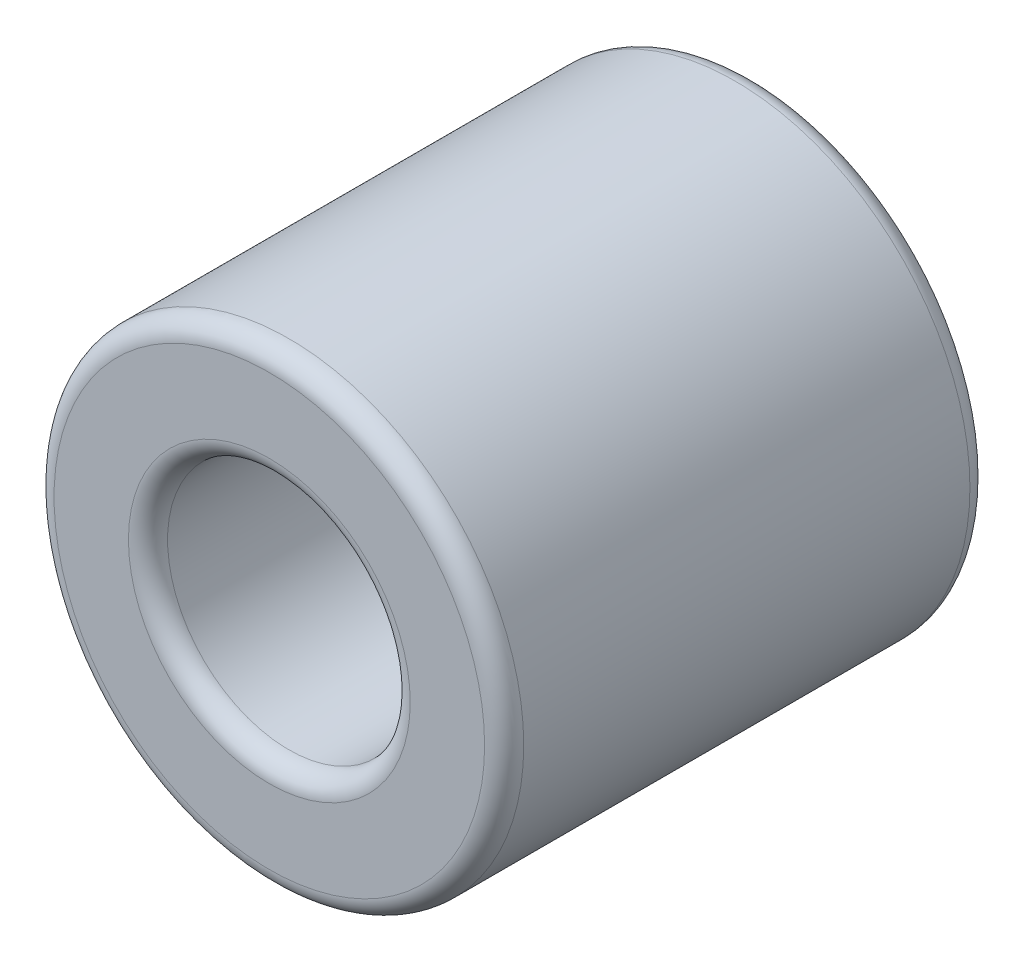
ISO-10303-21;
HEADER;
FILE_DESCRIPTION(('STEP AP214'),'2;1');
FILE_NAME('part.step','',(''),(''),'','','');
FILE_SCHEMA(('AUTOMOTIVE_DESIGN { 1 0 10303 214 1 1 1 1 }'));
ENDSEC;
DATA;
#1=APPLICATION_CONTEXT('core data for automotive mechanical design processes');
#2=APPLICATION_PROTOCOL_DEFINITION('international standard','automotive_design',2000,#1);
#3=PRODUCT_CONTEXT('',#1,'mechanical');
#4=PRODUCT('Part','Part','',(#3));
#5=PRODUCT_RELATED_PRODUCT_CATEGORY('part','',(#4));
#6=PRODUCT_DEFINITION_FORMATION('','',#4);
#7=PRODUCT_DEFINITION_CONTEXT('part definition',#1,'design');
#8=PRODUCT_DEFINITION('design','',#6,#7);
#9=PRODUCT_DEFINITION_SHAPE('','',#8);
#10=(LENGTH_UNIT() NAMED_UNIT(*) SI_UNIT(.MILLI.,.METRE.));
#11=(NAMED_UNIT(*) PLANE_ANGLE_UNIT() SI_UNIT($,.RADIAN.));
#12=(NAMED_UNIT(*) SI_UNIT($,.STERADIAN.) SOLID_ANGLE_UNIT());
#13=UNCERTAINTY_MEASURE_WITH_UNIT(LENGTH_MEASURE(1.E-05),#10,'distance_accuracy_value','');
#14=(GEOMETRIC_REPRESENTATION_CONTEXT(3) GLOBAL_UNCERTAINTY_ASSIGNED_CONTEXT((#13)) GLOBAL_UNIT_ASSIGNED_CONTEXT((#10,
#11,#12)) REPRESENTATION_CONTEXT('',''));
#15=CARTESIAN_POINT('',(0.,0.,0.));
#16=DIRECTION('',(0.,0.,1.));
#17=DIRECTION('',(1.,0.,0.));
#18=AXIS2_PLACEMENT_3D('',#15,#16,#17);
#19=CARTESIAN_POINT('',(0.,0.,6.2));
#20=DIRECTION('',(0.,0.,1.));
#21=DIRECTION('',(1.,0.,0.));
#22=AXIS2_PLACEMENT_3D('',#19,#20,#21);
#23=PLANE('',#22);
#24=CARTESIAN_POINT('',(0.,0.,6.2));
#25=DIRECTION('',(0.,0.,1.));
#26=DIRECTION('',(1.,0.,0.));
#27=AXIS2_PLACEMENT_3D('',#24,#25,#26);
#28=CIRCLE('',#27,1.8);
#29=CARTESIAN_POINT('',(1.8,0.,6.2));
#30=VERTEX_POINT('',#29);
#31=EDGE_CURVE('E42',#30,#30,#28,.F.);
#32=ORIENTED_EDGE('',*,*,#31,.T.);
#33=EDGE_LOOP('',(#32));
#34=FACE_BOUND('',#33,.T.);
#35=CARTESIAN_POINT('',(0.,0.,6.2));
#36=DIRECTION('',(0.,0.,1.));
#37=DIRECTION('',(1.,0.,0.));
#38=AXIS2_PLACEMENT_3D('',#35,#36,#37);
#39=CIRCLE('',#38,2.75);
#40=CARTESIAN_POINT('',(2.75,0.,6.2));
#41=VERTEX_POINT('',#40);
#42=EDGE_CURVE('E46',#41,#41,#39,.T.);
#43=ORIENTED_EDGE('',*,*,#42,.T.);
#44=EDGE_LOOP('',(#43));
#45=FACE_BOUND('',#44,.T.);
#46=ADVANCED_FACE('F31',(#34,#45),#23,.T.);
#47=CARTESIAN_POINT('',(0.,0.,0.));
#48=DIRECTION('',(0.,0.,1.));
#49=DIRECTION('',(1.,0.,0.));
#50=AXIS2_PLACEMENT_3D('',#47,#48,#49);
#51=PLANE('',#50);
#52=CARTESIAN_POINT('',(0.,0.,0.));
#53=DIRECTION('',(0.,0.,1.));
#54=DIRECTION('',(1.,0.,0.));
#55=AXIS2_PLACEMENT_3D('',#52,#53,#54);
#56=CIRCLE('',#55,1.8);
#57=CARTESIAN_POINT('',(1.8,0.,0.));
#58=VERTEX_POINT('',#57);
#59=EDGE_CURVE('E57',#58,#58,#56,.T.);
#60=ORIENTED_EDGE('',*,*,#59,.T.);
#61=EDGE_LOOP('',(#60));
#62=FACE_BOUND('',#61,.T.);
#63=CARTESIAN_POINT('',(0.,0.,0.));
#64=DIRECTION('',(0.,0.,1.));
#65=DIRECTION('',(1.,0.,0.));
#66=AXIS2_PLACEMENT_3D('',#63,#64,#65);
#67=CIRCLE('',#66,2.75);
#68=CARTESIAN_POINT('',(2.75,0.,0.));
#69=VERTEX_POINT('',#68);
#70=EDGE_CURVE('E60',#69,#69,#67,.F.);
#71=ORIENTED_EDGE('',*,*,#70,.T.);
#72=EDGE_LOOP('',(#71));
#73=FACE_BOUND('',#72,.T.);
#74=ADVANCED_FACE('F64',(#62,#73),#51,.F.);
#75=CARTESIAN_POINT('',(0.,0.,6.2));
#76=DIRECTION('',(0.,0.,-1.));
#77=DIRECTION('',(-1.,0.,0.));
#78=AXIS2_PLACEMENT_3D('',#75,#76,#77);
#79=CYLINDRICAL_SURFACE('',#78,3.);
#80=CARTESIAN_POINT('',(0.,0.,0.25));
#81=DIRECTION('',(0.,0.,1.));
#82=DIRECTION('',(1.,0.,0.));
#83=AXIS2_PLACEMENT_3D('',#80,#81,#82);
#84=CIRCLE('',#83,3.);
#85=CARTESIAN_POINT('',(3.,0.,0.25));
#86=VERTEX_POINT('',#85);
#87=EDGE_CURVE('E10',#86,#86,#84,.T.);
#88=ORIENTED_EDGE('',*,*,#87,.T.);
#89=EDGE_LOOP('',(#88));
#90=FACE_BOUND('',#89,.T.);
#91=CARTESIAN_POINT('',(0.,0.,5.95));
#92=DIRECTION('',(0.,0.,1.));
#93=DIRECTION('',(1.,0.,0.));
#94=AXIS2_PLACEMENT_3D('',#91,#92,#93);
#95=CIRCLE('',#94,3.);
#96=CARTESIAN_POINT('',(3.,0.,5.95));
#97=VERTEX_POINT('',#96);
#98=EDGE_CURVE('E38',#97,#97,#95,.F.);
#99=ORIENTED_EDGE('',*,*,#98,.T.);
#100=EDGE_LOOP('',(#99));
#101=FACE_BOUND('',#100,.T.);
#102=ADVANCED_FACE('F84',(#90,#101),#79,.T.);
#103=CARTESIAN_POINT('',(0.,0.,6.2));
#104=DIRECTION('',(0.,0.,-1.));
#105=DIRECTION('',(-1.,0.,0.));
#106=AXIS2_PLACEMENT_3D('',#103,#104,#105);
#107=CYLINDRICAL_SURFACE('',#106,1.55);
#108=CARTESIAN_POINT('',(0.,0.,0.25));
#109=DIRECTION('',(0.,0.,1.));
#110=DIRECTION('',(1.,0.,0.));
#111=AXIS2_PLACEMENT_3D('',#108,#109,#110);
#112=CIRCLE('',#111,1.55);
#113=CARTESIAN_POINT('',(1.55,0.,0.25));
#114=VERTEX_POINT('',#113);
#115=EDGE_CURVE('E51',#114,#114,#112,.F.);
#116=ORIENTED_EDGE('',*,*,#115,.T.);
#117=EDGE_LOOP('',(#116));
#118=FACE_BOUND('',#117,.T.);
#119=CARTESIAN_POINT('',(0.,0.,5.95));
#120=DIRECTION('',(0.,0.,1.));
#121=DIRECTION('',(1.,0.,0.));
#122=AXIS2_PLACEMENT_3D('',#119,#120,#121);
#123=CIRCLE('',#122,1.55);
#124=CARTESIAN_POINT('',(1.55,0.,5.95));
#125=VERTEX_POINT('',#124);
#126=EDGE_CURVE('E54',#125,#125,#123,.T.);
#127=ORIENTED_EDGE('',*,*,#126,.T.);
#128=EDGE_LOOP('',(#127));
#129=FACE_BOUND('',#128,.T.);
#130=ADVANCED_FACE('F89',(#118,#129),#107,.F.);
#131=CARTESIAN_POINT('',(0.,0.,0.25));
#132=DIRECTION('',(0.,0.,1.));
#133=DIRECTION('',(1.,0.,0.));
#134=AXIS2_PLACEMENT_3D('',#131,#132,#133);
#135=TOROIDAL_SURFACE('',#134,1.8,0.25);
#136=ORIENTED_EDGE('',*,*,#115,.F.);
#137=EDGE_LOOP('',(#136));
#138=FACE_BOUND('',#137,.T.);
#139=ORIENTED_EDGE('',*,*,#59,.F.);
#140=EDGE_LOOP('',(#139));
#141=FACE_BOUND('',#140,.T.);
#142=ADVANCED_FACE('F75',(#138,#141),#135,.T.);
#143=CARTESIAN_POINT('',(0.,0.,5.95));
#144=DIRECTION('',(0.,0.,1.));
#145=DIRECTION('',(1.,0.,0.));
#146=AXIS2_PLACEMENT_3D('',#143,#144,#145);
#147=TOROIDAL_SURFACE('',#146,1.8,0.25);
#148=ORIENTED_EDGE('',*,*,#31,.F.);
#149=EDGE_LOOP('',(#148));
#150=FACE_BOUND('',#149,.T.);
#151=ORIENTED_EDGE('',*,*,#126,.F.);
#152=EDGE_LOOP('',(#151));
#153=FACE_BOUND('',#152,.T.);
#154=ADVANCED_FACE('F69',(#150,#153),#147,.T.);
#155=CARTESIAN_POINT('',(0.,0.,0.25));
#156=DIRECTION('',(0.,0.,1.));
#157=DIRECTION('',(1.,0.,0.));
#158=AXIS2_PLACEMENT_3D('',#155,#156,#157);
#159=TOROIDAL_SURFACE('',#158,2.75,0.25);
#160=ORIENTED_EDGE('',*,*,#70,.F.);
#161=EDGE_LOOP('',(#160));
#162=FACE_BOUND('',#161,.T.);
#163=ORIENTED_EDGE('',*,*,#87,.F.);
#164=EDGE_LOOP('',(#163));
#165=FACE_BOUND('',#164,.T.);
#166=ADVANCED_FACE('F66',(#162,#165),#159,.T.);
#167=CARTESIAN_POINT('',(0.,0.,5.95));
#168=DIRECTION('',(0.,0.,1.));
#169=DIRECTION('',(1.,0.,0.));
#170=AXIS2_PLACEMENT_3D('',#167,#168,#169);
#171=TOROIDAL_SURFACE('',#170,2.75,0.25);
#172=ORIENTED_EDGE('',*,*,#98,.F.);
#173=EDGE_LOOP('',(#172));
#174=FACE_BOUND('',#173,.T.);
#175=ORIENTED_EDGE('',*,*,#42,.F.);
#176=EDGE_LOOP('',(#175));
#177=FACE_BOUND('',#176,.T.);
#178=ADVANCED_FACE('F33',(#174,#177),#171,.T.);
#179=CLOSED_SHELL('',(#46,#74,#102,#130,#142,#154,#166,#178));
#180=MANIFOLD_SOLID_BREP('B2',#179);
#181=ADVANCED_BREP_SHAPE_REPRESENTATION('',(#18,#180),#14);
#182=SHAPE_DEFINITION_REPRESENTATION(#9,#181);
ENDSEC;
END-ISO-10303-21;
